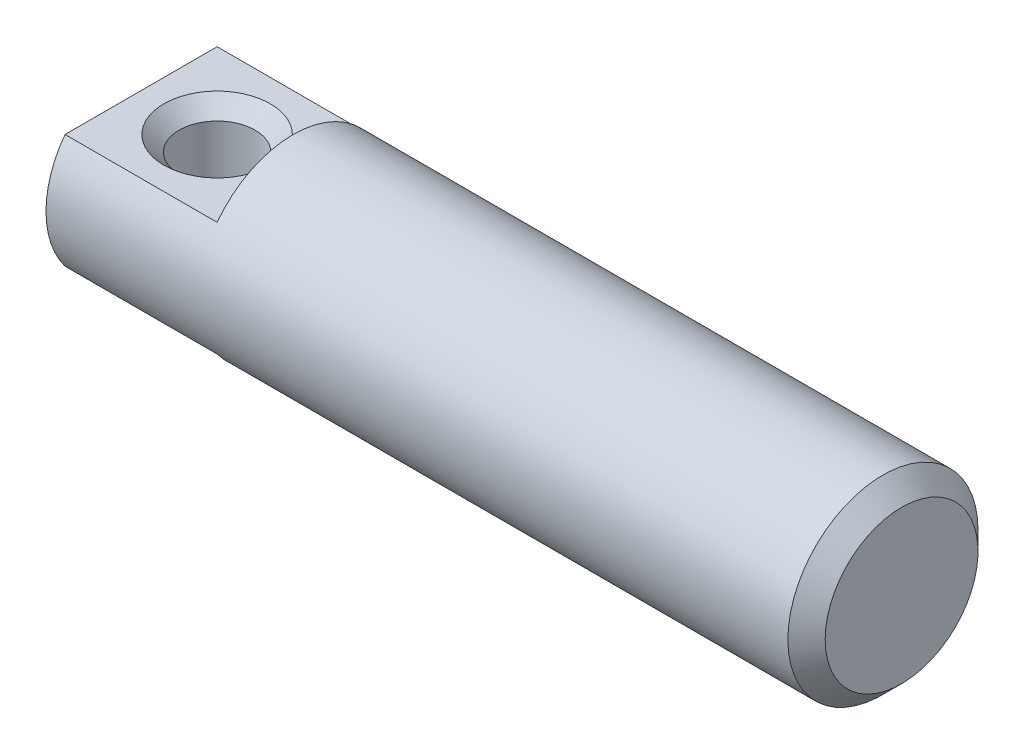
ISO-10303-21;
HEADER;
FILE_DESCRIPTION(('STEP AP214'),'2;1');
FILE_NAME('part.step','',(''),(''),'','','');
FILE_SCHEMA(('AUTOMOTIVE_DESIGN { 1 0 10303 214 1 1 1 1 }'));
ENDSEC;
DATA;
#1=APPLICATION_CONTEXT('core data for automotive mechanical design processes');
#2=APPLICATION_PROTOCOL_DEFINITION('international standard','automotive_design',2000,#1);
#3=PRODUCT_CONTEXT('',#1,'mechanical');
#4=PRODUCT('Part','Part','',(#3));
#5=PRODUCT_RELATED_PRODUCT_CATEGORY('part','',(#4));
#6=PRODUCT_DEFINITION_FORMATION('','',#4);
#7=PRODUCT_DEFINITION_CONTEXT('part definition',#1,'design');
#8=PRODUCT_DEFINITION('design','',#6,#7);
#9=PRODUCT_DEFINITION_SHAPE('','',#8);
#10=(LENGTH_UNIT() NAMED_UNIT(*) SI_UNIT(.MILLI.,.METRE.));
#11=(NAMED_UNIT(*) PLANE_ANGLE_UNIT() SI_UNIT($,.RADIAN.));
#12=(NAMED_UNIT(*) SI_UNIT($,.STERADIAN.) SOLID_ANGLE_UNIT());
#13=UNCERTAINTY_MEASURE_WITH_UNIT(LENGTH_MEASURE(1.E-05),#10,'distance_accuracy_value','');
#14=(GEOMETRIC_REPRESENTATION_CONTEXT(3) GLOBAL_UNCERTAINTY_ASSIGNED_CONTEXT((#13)) GLOBAL_UNIT_ASSIGNED_CONTEXT((#10,
#11,#12)) REPRESENTATION_CONTEXT('',''));
#15=CARTESIAN_POINT('',(0.,0.,0.));
#16=DIRECTION('',(0.,0.,1.));
#17=DIRECTION('',(1.,0.,0.));
#18=AXIS2_PLACEMENT_3D('',#15,#16,#17);
#19=CARTESIAN_POINT('',(0.,1.5,2.5));
#20=DIRECTION('',(0.,1.,0.));
#21=DIRECTION('',(0.,0.,1.));
#22=AXIS2_PLACEMENT_3D('',#19,#20,#21);
#23=PLANE('',#22);
#24=DIRECTION('',(-1.,0.,0.));
#25=VECTOR('',#24,1.);
#26=CARTESIAN_POINT('',(20.,1.5,-2.));
#27=LINE('',#26,#25);
#28=CARTESIAN_POINT('',(4.,1.5,-2.));
#29=VERTEX_POINT('',#28);
#30=CARTESIAN_POINT('',(0.,1.5,-2.));
#31=VERTEX_POINT('',#30);
#32=EDGE_CURVE('E82',#29,#31,#27,.T.);
#33=ORIENTED_EDGE('',*,*,#32,.T.);
#34=DIRECTION('',(0.,0.,-1.));
#35=VECTOR('',#34,1.);
#36=CARTESIAN_POINT('',(0.,1.5,2.5));
#37=LINE('',#36,#35);
#38=CARTESIAN_POINT('',(0.,1.5,2.));
#39=VERTEX_POINT('',#38);
#40=EDGE_CURVE('E83',#39,#31,#37,.T.);
#41=ORIENTED_EDGE('',*,*,#40,.F.);
#42=DIRECTION('',(-1.,0.,0.));
#43=VECTOR('',#42,1.);
#44=CARTESIAN_POINT('',(20.,1.5,2.));
#45=LINE('',#44,#43);
#46=CARTESIAN_POINT('',(4.,1.5,2.));
#47=VERTEX_POINT('',#46);
#48=EDGE_CURVE('E77',#39,#47,#45,.F.);
#49=ORIENTED_EDGE('',*,*,#48,.T.);
#50=DIRECTION('',(0.,0.,-1.));
#51=VECTOR('',#50,1.);
#52=CARTESIAN_POINT('',(4.,1.5,2.5));
#53=LINE('',#52,#51);
#54=EDGE_CURVE('E45',#47,#29,#53,.T.);
#55=ORIENTED_EDGE('',*,*,#54,.T.);
#56=EDGE_LOOP('',(#33,#41,#49,#55));
#57=FACE_BOUND('',#56,.T.);
#58=CARTESIAN_POINT('',(2.,1.5,0.));
#59=DIRECTION('',(0.,1.,0.));
#60=DIRECTION('',(0.,0.,1.));
#61=AXIS2_PLACEMENT_3D('',#58,#59,#60);
#62=CIRCLE('',#61,1.4);
#63=CARTESIAN_POINT('',(2.,1.5,1.4));
#64=VERTEX_POINT('',#63);
#65=EDGE_CURVE('E84',#64,#64,#62,.T.);
#66=ORIENTED_EDGE('',*,*,#65,.F.);
#67=EDGE_LOOP('',(#66));
#68=FACE_BOUND('',#67,.T.);
#69=ADVANCED_FACE('F31',(#57,#68),#23,.T.);
#70=CARTESIAN_POINT('',(4.,-1.5,2.5));
#71=DIRECTION('',(0.,-1.,0.));
#72=DIRECTION('',(0.,0.,-1.));
#73=AXIS2_PLACEMENT_3D('',#70,#71,#72);
#74=PLANE('',#73);
#75=DIRECTION('',(-1.,0.,0.));
#76=VECTOR('',#75,1.);
#77=CARTESIAN_POINT('',(20.,-1.5,2.));
#78=LINE('',#77,#76);
#79=CARTESIAN_POINT('',(4.,-1.5,2.));
#80=VERTEX_POINT('',#79);
#81=CARTESIAN_POINT('',(0.,-1.5,2.));
#82=VERTEX_POINT('',#81);
#83=EDGE_CURVE('E11',#80,#82,#78,.T.);
#84=ORIENTED_EDGE('',*,*,#83,.T.);
#85=DIRECTION('',(0.,0.,-1.));
#86=VECTOR('',#85,1.);
#87=CARTESIAN_POINT('',(0.,-1.5,2.5));
#88=LINE('',#87,#86);
#89=CARTESIAN_POINT('',(0.,-1.5,-2.));
#90=VERTEX_POINT('',#89);
#91=EDGE_CURVE('E103',#82,#90,#88,.T.);
#92=ORIENTED_EDGE('',*,*,#91,.T.);
#93=DIRECTION('',(-1.,0.,0.));
#94=VECTOR('',#93,1.);
#95=CARTESIAN_POINT('',(20.,-1.5,-2.));
#96=LINE('',#95,#94);
#97=CARTESIAN_POINT('',(4.,-1.5,-2.));
#98=VERTEX_POINT('',#97);
#99=EDGE_CURVE('E89',#90,#98,#96,.F.);
#100=ORIENTED_EDGE('',*,*,#99,.T.);
#101=DIRECTION('',(0.,0.,-1.));
#102=VECTOR('',#101,1.);
#103=CARTESIAN_POINT('',(4.,-1.5,2.5));
#104=LINE('',#103,#102);
#105=EDGE_CURVE('E98',#80,#98,#104,.T.);
#106=ORIENTED_EDGE('',*,*,#105,.F.);
#107=EDGE_LOOP('',(#84,#92,#100,#106));
#108=FACE_BOUND('',#107,.T.);
#109=CARTESIAN_POINT('',(2.,-1.5,0.));
#110=DIRECTION('',(0.,1.,0.));
#111=DIRECTION('',(0.,0.,1.));
#112=AXIS2_PLACEMENT_3D('',#109,#110,#111);
#113=CIRCLE('',#112,1.4);
#114=CARTESIAN_POINT('',(2.,-1.5,1.4));
#115=VERTEX_POINT('',#114);
#116=EDGE_CURVE('E123',#115,#115,#113,.T.);
#117=ORIENTED_EDGE('',*,*,#116,.T.);
#118=EDGE_LOOP('',(#117));
#119=FACE_BOUND('',#118,.T.);
#120=ADVANCED_FACE('F100',(#108,#119),#74,.T.);
#121=CARTESIAN_POINT('',(0.,0.,0.));
#122=DIRECTION('',(1.,0.,0.));
#123=DIRECTION('',(0.,0.,-1.));
#124=AXIS2_PLACEMENT_3D('',#121,#122,#123);
#125=PLANE('',#124);
#126=ORIENTED_EDGE('',*,*,#91,.F.);
#127=CARTESIAN_POINT('',(0.,0.,0.));
#128=DIRECTION('',(-1.,0.,0.));
#129=DIRECTION('',(0.,0.,1.));
#130=AXIS2_PLACEMENT_3D('',#127,#128,#129);
#131=CIRCLE('',#130,2.5);
#132=EDGE_CURVE('E78',#82,#39,#131,.T.);
#133=ORIENTED_EDGE('',*,*,#132,.T.);
#134=ORIENTED_EDGE('',*,*,#40,.T.);
#135=EDGE_CURVE('E53',#31,#90,#131,.T.);
#136=ORIENTED_EDGE('',*,*,#135,.T.);
#137=EDGE_LOOP('',(#126,#133,#134,#136));
#138=FACE_BOUND('',#137,.T.);
#139=ADVANCED_FACE('F33',(#138),#125,.F.);
#140=CARTESIAN_POINT('',(20.,0.,0.));
#141=DIRECTION('',(-1.,0.,0.));
#142=DIRECTION('',(0.,0.,1.));
#143=AXIS2_PLACEMENT_3D('',#140,#141,#142);
#144=CYLINDRICAL_SURFACE('',#143,2.5);
#145=CARTESIAN_POINT('',(19.5095,0.,0.));
#146=DIRECTION('',(-1.,0.,0.));
#147=DIRECTION('',(0.,0.,1.));
#148=AXIS2_PLACEMENT_3D('',#145,#146,#147);
#149=CIRCLE('',#148,2.5);
#150=CARTESIAN_POINT('',(19.5095,0.,2.5));
#151=VERTEX_POINT('',#150);
#152=EDGE_CURVE('E107',#151,#151,#149,.T.);
#153=ORIENTED_EDGE('',*,*,#152,.T.);
#154=EDGE_LOOP('',(#153));
#155=FACE_BOUND('',#154,.T.);
#156=ORIENTED_EDGE('',*,*,#83,.F.);
#157=CARTESIAN_POINT('',(4.,0.,0.));
#158=DIRECTION('',(-1.,0.,0.));
#159=DIRECTION('',(0.,0.,1.));
#160=AXIS2_PLACEMENT_3D('',#157,#158,#159);
#161=CIRCLE('',#160,2.5);
#162=EDGE_CURVE('E39',#98,#80,#161,.T.);
#163=ORIENTED_EDGE('',*,*,#162,.F.);
#164=ORIENTED_EDGE('',*,*,#99,.F.);
#165=ORIENTED_EDGE('',*,*,#135,.F.);
#166=ORIENTED_EDGE('',*,*,#32,.F.);
#167=CARTESIAN_POINT('',(4.,0.,0.));
#168=DIRECTION('',(-1.,0.,0.));
#169=DIRECTION('',(0.,0.,1.));
#170=AXIS2_PLACEMENT_3D('',#167,#168,#169);
#171=CIRCLE('',#170,2.5);
#172=EDGE_CURVE('E72',#47,#29,#171,.T.);
#173=ORIENTED_EDGE('',*,*,#172,.F.);
#174=ORIENTED_EDGE('',*,*,#48,.F.);
#175=ORIENTED_EDGE('',*,*,#132,.F.);
#176=EDGE_LOOP('',(#156,#163,#164,#165,#166,#173,#174,#175));
#177=FACE_BOUND('',#176,.T.);
#178=ADVANCED_FACE('F87',(#155,#177),#144,.T.);
#179=CARTESIAN_POINT('',(20.,0.,0.));
#180=DIRECTION('',(-1.,0.,0.));
#181=DIRECTION('',(0.,0.,1.));
#182=AXIS2_PLACEMENT_3D('',#179,#180,#181);
#183=CONICAL_SURFACE('',#182,2.0095,0.785398163397447);
#184=ORIENTED_EDGE('',*,*,#152,.F.);
#185=EDGE_LOOP('',(#184));
#186=FACE_BOUND('',#185,.T.);
#187=CARTESIAN_POINT('',(20.,0.,0.));
#188=DIRECTION('',(-1.,0.,0.));
#189=DIRECTION('',(0.,0.,1.));
#190=AXIS2_PLACEMENT_3D('',#187,#188,#189);
#191=CIRCLE('',#190,2.0095);
#192=CARTESIAN_POINT('',(20.,0.,2.0095));
#193=VERTEX_POINT('',#192);
#194=EDGE_CURVE('E102',#193,#193,#191,.T.);
#195=ORIENTED_EDGE('',*,*,#194,.T.);
#196=EDGE_LOOP('',(#195));
#197=FACE_BOUND('',#196,.T.);
#198=ADVANCED_FACE('F152',(#186,#197),#183,.T.);
#199=CARTESIAN_POINT('',(20.,2.0095,0.));
#200=DIRECTION('',(-1.,0.,0.));
#201=DIRECTION('',(0.,0.,1.));
#202=AXIS2_PLACEMENT_3D('',#199,#200,#201);
#203=PLANE('',#202);
#204=ORIENTED_EDGE('',*,*,#194,.F.);
#205=EDGE_LOOP('',(#204));
#206=FACE_BOUND('',#205,.T.);
#207=ADVANCED_FACE('F149',(#206),#203,.F.);
#208=CARTESIAN_POINT('',(4.,1.5,2.5));
#209=DIRECTION('',(-1.,0.,0.));
#210=DIRECTION('',(0.,0.,1.));
#211=AXIS2_PLACEMENT_3D('',#208,#209,#210);
#212=PLANE('',#211);
#213=ORIENTED_EDGE('',*,*,#172,.T.);
#214=ORIENTED_EDGE('',*,*,#54,.F.);
#215=EDGE_LOOP('',(#213,#214));
#216=FACE_BOUND('',#215,.T.);
#217=ADVANCED_FACE('F73',(#216),#212,.T.);
#218=CARTESIAN_POINT('',(4.,-3.,2.5));
#219=DIRECTION('',(-1.,0.,0.));
#220=DIRECTION('',(0.,0.,1.));
#221=AXIS2_PLACEMENT_3D('',#218,#219,#220);
#222=PLANE('',#221);
#223=ORIENTED_EDGE('',*,*,#162,.T.);
#224=ORIENTED_EDGE('',*,*,#105,.T.);
#225=EDGE_LOOP('',(#223,#224));
#226=FACE_BOUND('',#225,.T.);
#227=ADVANCED_FACE('F97',(#226),#222,.T.);
#228=CARTESIAN_POINT('',(2.,1.1,0.));
#229=DIRECTION('',(0.,1.,0.));
#230=DIRECTION('',(0.,0.,1.));
#231=AXIS2_PLACEMENT_3D('',#228,#229,#230);
#232=CONICAL_SURFACE('',#231,1.,0.785398163397448);
#233=ORIENTED_EDGE('',*,*,#65,.T.);
#234=EDGE_LOOP('',(#233));
#235=FACE_BOUND('',#234,.T.);
#236=CARTESIAN_POINT('',(2.,1.1,0.));
#237=DIRECTION('',(0.,1.,0.));
#238=DIRECTION('',(0.,0.,1.));
#239=AXIS2_PLACEMENT_3D('',#236,#237,#238);
#240=CIRCLE('',#239,1.);
#241=CARTESIAN_POINT('',(2.,1.1,1.));
#242=VERTEX_POINT('',#241);
#243=EDGE_CURVE('E117',#242,#242,#240,.T.);
#244=ORIENTED_EDGE('',*,*,#243,.F.);
#245=EDGE_LOOP('',(#244));
#246=FACE_BOUND('',#245,.T.);
#247=ADVANCED_FACE('F135',(#235,#246),#232,.F.);
#248=CARTESIAN_POINT('',(2.,-1.5,0.));
#249=DIRECTION('',(0.,1.,0.));
#250=DIRECTION('',(0.,0.,1.));
#251=AXIS2_PLACEMENT_3D('',#248,#249,#250);
#252=CYLINDRICAL_SURFACE('',#251,1.);
#253=ORIENTED_EDGE('',*,*,#243,.T.);
#254=EDGE_LOOP('',(#253));
#255=FACE_BOUND('',#254,.T.);
#256=CARTESIAN_POINT('',(2.,-1.1,0.));
#257=DIRECTION('',(0.,1.,0.));
#258=DIRECTION('',(0.,0.,1.));
#259=AXIS2_PLACEMENT_3D('',#256,#257,#258);
#260=CIRCLE('',#259,1.);
#261=CARTESIAN_POINT('',(2.,-1.1,1.));
#262=VERTEX_POINT('',#261);
#263=EDGE_CURVE('E120',#262,#262,#260,.T.);
#264=ORIENTED_EDGE('',*,*,#263,.F.);
#265=EDGE_LOOP('',(#264));
#266=FACE_BOUND('',#265,.T.);
#267=ADVANCED_FACE('F129',(#255,#266),#252,.F.);
#268=CARTESIAN_POINT('',(2.,-1.5,0.));
#269=DIRECTION('',(0.,-1.,0.));
#270=DIRECTION('',(0.,0.,-1.));
#271=AXIS2_PLACEMENT_3D('',#268,#269,#270);
#272=CONICAL_SURFACE('',#271,1.4,0.785398163397448);
#273=ORIENTED_EDGE('',*,*,#263,.T.);
#274=EDGE_LOOP('',(#273));
#275=FACE_BOUND('',#274,.T.);
#276=ORIENTED_EDGE('',*,*,#116,.F.);
#277=EDGE_LOOP('',(#276));
#278=FACE_BOUND('',#277,.T.);
#279=ADVANCED_FACE('F127',(#275,#278),#272,.F.);
#280=CLOSED_SHELL('',(#69,#120,#139,#178,#198,#207,#217,#227,#247,#267,#279));
#281=MANIFOLD_SOLID_BREP('B2',#280);
#282=ADVANCED_BREP_SHAPE_REPRESENTATION('',(#18,#281),#14);
#283=SHAPE_DEFINITION_REPRESENTATION(#9,#282);
ENDSEC;
END-ISO-10303-21;
